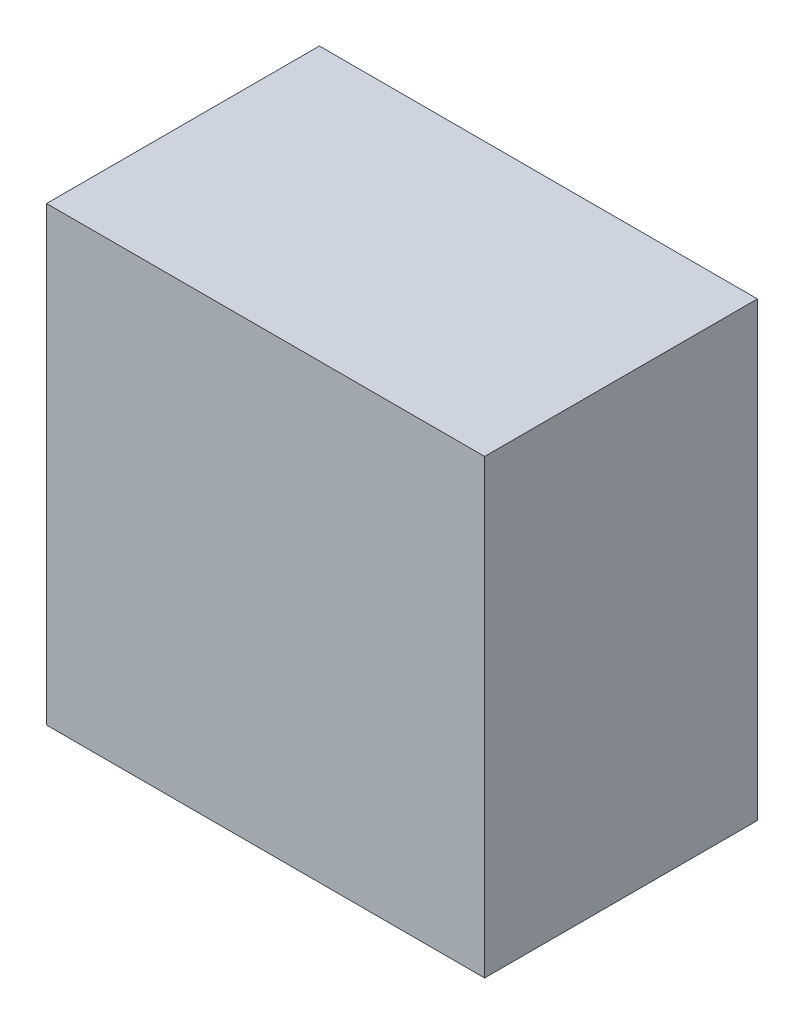
ISO-10303-21;
HEADER;
FILE_DESCRIPTION(('STEP AP214'),'2;1');
FILE_NAME('part.step','',(''),(''),'','','');
FILE_SCHEMA(('AUTOMOTIVE_DESIGN { 1 0 10303 214 1 1 1 1 }'));
ENDSEC;
DATA;
#1=APPLICATION_CONTEXT('core data for automotive mechanical design processes');
#2=APPLICATION_PROTOCOL_DEFINITION('international standard','automotive_design',2000,#1);
#3=PRODUCT_CONTEXT('',#1,'mechanical');
#4=PRODUCT('Part','Part','',(#3));
#5=PRODUCT_RELATED_PRODUCT_CATEGORY('part','',(#4));
#6=PRODUCT_DEFINITION_FORMATION('','',#4);
#7=PRODUCT_DEFINITION_CONTEXT('part definition',#1,'design');
#8=PRODUCT_DEFINITION('design','',#6,#7);
#9=PRODUCT_DEFINITION_SHAPE('','',#8);
#10=(LENGTH_UNIT() NAMED_UNIT(*) SI_UNIT(.MILLI.,.METRE.));
#11=(NAMED_UNIT(*) PLANE_ANGLE_UNIT() SI_UNIT($,.RADIAN.));
#12=(NAMED_UNIT(*) SI_UNIT($,.STERADIAN.) SOLID_ANGLE_UNIT());
#13=UNCERTAINTY_MEASURE_WITH_UNIT(LENGTH_MEASURE(1.E-05),#10,'distance_accuracy_value','');
#14=(GEOMETRIC_REPRESENTATION_CONTEXT(3) GLOBAL_UNCERTAINTY_ASSIGNED_CONTEXT((#13)) GLOBAL_UNIT_ASSIGNED_CONTEXT((#10,
#11,#12)) REPRESENTATION_CONTEXT('',''));
#15=CARTESIAN_POINT('',(0.,0.,0.));
#16=DIRECTION('',(0.,0.,1.));
#17=DIRECTION('',(1.,0.,0.));
#18=AXIS2_PLACEMENT_3D('',#15,#16,#17);
#19=CARTESIAN_POINT('',(72.25,74.5,90.));
#20=DIRECTION('',(-1.,0.,0.));
#21=DIRECTION('',(0.,-1.,0.));
#22=AXIS2_PLACEMENT_3D('',#19,#20,#21);
#23=PLANE('',#22);
#24=DIRECTION('',(0.,1.,0.));
#25=VECTOR('',#24,1.);
#26=CARTESIAN_POINT('',(72.25,74.5,0.));
#27=LINE('',#26,#25);
#28=CARTESIAN_POINT('',(72.25,-74.5,0.));
#29=VERTEX_POINT('',#28);
#30=CARTESIAN_POINT('',(72.25,74.5,0.));
#31=VERTEX_POINT('',#30);
#32=EDGE_CURVE('E96',#29,#31,#27,.T.);
#33=ORIENTED_EDGE('',*,*,#32,.T.);
#34=DIRECTION('',(0.,0.,-1.));
#35=VECTOR('',#34,1.);
#36=CARTESIAN_POINT('',(72.25,74.5,90.));
#37=LINE('',#36,#35);
#38=CARTESIAN_POINT('',(72.25,74.5,90.));
#39=VERTEX_POINT('',#38);
#40=EDGE_CURVE('E11',#39,#31,#37,.T.);
#41=ORIENTED_EDGE('',*,*,#40,.F.);
#42=DIRECTION('',(0.,1.,0.));
#43=VECTOR('',#42,1.);
#44=CARTESIAN_POINT('',(72.25,74.5,90.));
#45=LINE('',#44,#43);
#46=CARTESIAN_POINT('',(72.25,-74.5,90.));
#47=VERTEX_POINT('',#46);
#48=EDGE_CURVE('E84',#47,#39,#45,.T.);
#49=ORIENTED_EDGE('',*,*,#48,.F.);
#50=DIRECTION('',(0.,0.,-1.));
#51=VECTOR('',#50,1.);
#52=CARTESIAN_POINT('',(72.25,-74.5,90.));
#53=LINE('',#52,#51);
#54=EDGE_CURVE('E92',#47,#29,#53,.T.);
#55=ORIENTED_EDGE('',*,*,#54,.T.);
#56=EDGE_LOOP('',(#33,#41,#49,#55));
#57=FACE_BOUND('',#56,.T.);
#58=ADVANCED_FACE('F33',(#57),#23,.F.);
#59=CARTESIAN_POINT('',(-72.25,74.5,90.));
#60=DIRECTION('',(0.,-1.,0.));
#61=DIRECTION('',(0.,0.,-1.));
#62=AXIS2_PLACEMENT_3D('',#59,#60,#61);
#63=PLANE('',#62);
#64=DIRECTION('',(-1.,0.,0.));
#65=VECTOR('',#64,1.);
#66=CARTESIAN_POINT('',(-72.25,74.5,0.));
#67=LINE('',#66,#65);
#68=CARTESIAN_POINT('',(-72.25,74.5,0.));
#69=VERTEX_POINT('',#68);
#70=EDGE_CURVE('E88',#31,#69,#67,.T.);
#71=ORIENTED_EDGE('',*,*,#70,.T.);
#72=DIRECTION('',(0.,0.,-1.));
#73=VECTOR('',#72,1.);
#74=CARTESIAN_POINT('',(-72.25,74.5,90.));
#75=LINE('',#74,#73);
#76=CARTESIAN_POINT('',(-72.25,74.5,90.));
#77=VERTEX_POINT('',#76);
#78=EDGE_CURVE('E41',#77,#69,#75,.T.);
#79=ORIENTED_EDGE('',*,*,#78,.F.);
#80=DIRECTION('',(-1.,0.,0.));
#81=VECTOR('',#80,1.);
#82=CARTESIAN_POINT('',(-72.25,74.5,90.));
#83=LINE('',#82,#81);
#84=EDGE_CURVE('E79',#39,#77,#83,.T.);
#85=ORIENTED_EDGE('',*,*,#84,.F.);
#86=ORIENTED_EDGE('',*,*,#40,.T.);
#87=EDGE_LOOP('',(#71,#79,#85,#86));
#88=FACE_BOUND('',#87,.T.);
#89=ADVANCED_FACE('F87',(#88),#63,.F.);
#90=CARTESIAN_POINT('',(-72.25,74.5,90.));
#91=DIRECTION('',(1.,0.,0.));
#92=DIRECTION('',(0.,1.,0.));
#93=AXIS2_PLACEMENT_3D('',#90,#91,#92);
#94=PLANE('',#93);
#95=DIRECTION('',(0.,-1.,0.));
#96=VECTOR('',#95,1.);
#97=CARTESIAN_POINT('',(-72.25,74.5,0.));
#98=LINE('',#97,#96);
#99=CARTESIAN_POINT('',(-72.25,-74.5,0.));
#100=VERTEX_POINT('',#99);
#101=EDGE_CURVE('E66',#69,#100,#98,.T.);
#102=ORIENTED_EDGE('',*,*,#101,.T.);
#103=DIRECTION('',(0.,0.,-1.));
#104=VECTOR('',#103,1.);
#105=CARTESIAN_POINT('',(-72.25,-74.5,90.));
#106=LINE('',#105,#104);
#107=CARTESIAN_POINT('',(-72.25,-74.5,90.));
#108=VERTEX_POINT('',#107);
#109=EDGE_CURVE('E89',#108,#100,#106,.T.);
#110=ORIENTED_EDGE('',*,*,#109,.F.);
#111=DIRECTION('',(0.,-1.,0.));
#112=VECTOR('',#111,1.);
#113=CARTESIAN_POINT('',(-72.25,74.5,90.));
#114=LINE('',#113,#112);
#115=EDGE_CURVE('E82',#77,#108,#114,.T.);
#116=ORIENTED_EDGE('',*,*,#115,.F.);
#117=ORIENTED_EDGE('',*,*,#78,.T.);
#118=EDGE_LOOP('',(#102,#110,#116,#117));
#119=FACE_BOUND('',#118,.T.);
#120=ADVANCED_FACE('F90',(#119),#94,.F.);
#121=CARTESIAN_POINT('',(-72.25,-74.5,90.));
#122=DIRECTION('',(0.,1.,0.));
#123=DIRECTION('',(0.,0.,1.));
#124=AXIS2_PLACEMENT_3D('',#121,#122,#123);
#125=PLANE('',#124);
#126=DIRECTION('',(1.,0.,0.));
#127=VECTOR('',#126,1.);
#128=CARTESIAN_POINT('',(-72.25,-74.5,0.));
#129=LINE('',#128,#127);
#130=EDGE_CURVE('E72',#100,#29,#129,.T.);
#131=ORIENTED_EDGE('',*,*,#130,.T.);
#132=ORIENTED_EDGE('',*,*,#54,.F.);
#133=DIRECTION('',(1.,0.,0.));
#134=VECTOR('',#133,1.);
#135=CARTESIAN_POINT('',(-72.25,-74.5,90.));
#136=LINE('',#135,#134);
#137=EDGE_CURVE('E49',#108,#47,#136,.T.);
#138=ORIENTED_EDGE('',*,*,#137,.F.);
#139=ORIENTED_EDGE('',*,*,#109,.T.);
#140=EDGE_LOOP('',(#131,#132,#138,#139));
#141=FACE_BOUND('',#140,.T.);
#142=ADVANCED_FACE('F103',(#141),#125,.F.);
#143=CARTESIAN_POINT('',(0.,0.,90.));
#144=DIRECTION('',(0.,0.,1.));
#145=DIRECTION('',(1.,0.,0.));
#146=AXIS2_PLACEMENT_3D('',#143,#144,#145);
#147=PLANE('',#146);
#148=ORIENTED_EDGE('',*,*,#48,.T.);
#149=ORIENTED_EDGE('',*,*,#84,.T.);
#150=ORIENTED_EDGE('',*,*,#115,.T.);
#151=ORIENTED_EDGE('',*,*,#137,.T.);
#152=EDGE_LOOP('',(#148,#149,#150,#151));
#153=FACE_BOUND('',#152,.T.);
#154=ADVANCED_FACE('F80',(#153),#147,.T.);
#155=CARTESIAN_POINT('',(0.,0.,0.));
#156=DIRECTION('',(0.,0.,1.));
#157=DIRECTION('',(1.,0.,0.));
#158=AXIS2_PLACEMENT_3D('',#155,#156,#157);
#159=PLANE('',#158);
#160=ORIENTED_EDGE('',*,*,#32,.F.);
#161=ORIENTED_EDGE('',*,*,#130,.F.);
#162=ORIENTED_EDGE('',*,*,#101,.F.);
#163=ORIENTED_EDGE('',*,*,#70,.F.);
#164=EDGE_LOOP('',(#160,#161,#162,#163));
#165=FACE_BOUND('',#164,.T.);
#166=ADVANCED_FACE('F106',(#165),#159,.F.);
#167=CLOSED_SHELL('',(#58,#89,#120,#142,#154,#166));
#168=MANIFOLD_SOLID_BREP('B2',#167);
#169=ADVANCED_BREP_SHAPE_REPRESENTATION('',(#18,#168),#14);
#170=SHAPE_DEFINITION_REPRESENTATION(#9,#169);
ENDSEC;
END-ISO-10303-21;
